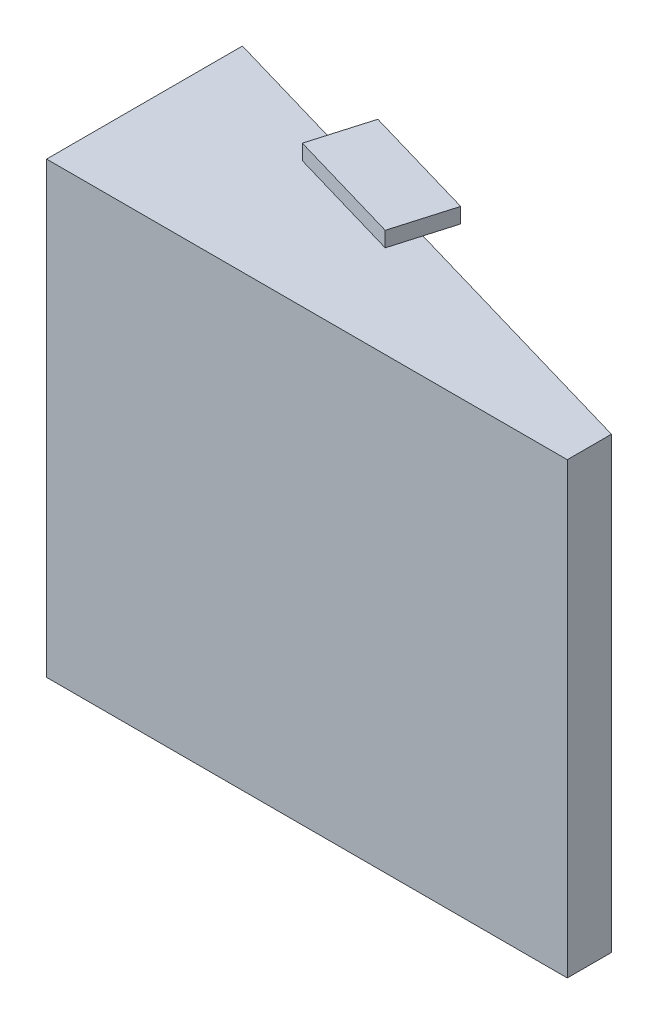
ISO-10303-21;
HEADER;
FILE_DESCRIPTION(('STEP AP214'),'2;1');
FILE_NAME('part.step','',(''),(''),'','','');
FILE_SCHEMA(('AUTOMOTIVE_DESIGN { 1 0 10303 214 1 1 1 1 }'));
ENDSEC;
DATA;
#1=APPLICATION_CONTEXT('core data for automotive mechanical design processes');
#2=APPLICATION_PROTOCOL_DEFINITION('international standard','automotive_design',2000,#1);
#3=PRODUCT_CONTEXT('',#1,'mechanical');
#4=PRODUCT('Part','Part','',(#3));
#5=PRODUCT_RELATED_PRODUCT_CATEGORY('part','',(#4));
#6=PRODUCT_DEFINITION_FORMATION('','',#4);
#7=PRODUCT_DEFINITION_CONTEXT('part definition',#1,'design');
#8=PRODUCT_DEFINITION('design','',#6,#7);
#9=PRODUCT_DEFINITION_SHAPE('','',#8);
#10=(LENGTH_UNIT() NAMED_UNIT(*) SI_UNIT(.MILLI.,.METRE.));
#11=(NAMED_UNIT(*) PLANE_ANGLE_UNIT() SI_UNIT($,.RADIAN.));
#12=(NAMED_UNIT(*) SI_UNIT($,.STERADIAN.) SOLID_ANGLE_UNIT());
#13=UNCERTAINTY_MEASURE_WITH_UNIT(LENGTH_MEASURE(1.E-05),#10,'distance_accuracy_value','');
#14=(GEOMETRIC_REPRESENTATION_CONTEXT(3) GLOBAL_UNCERTAINTY_ASSIGNED_CONTEXT((#13)) GLOBAL_UNIT_ASSIGNED_CONTEXT((#10,
#11,#12)) REPRESENTATION_CONTEXT('',''));
#15=CARTESIAN_POINT('',(0.,0.,0.));
#16=DIRECTION('',(0.,0.,1.));
#17=DIRECTION('',(1.,0.,0.));
#18=AXIS2_PLACEMENT_3D('',#15,#16,#17);
#19=CARTESIAN_POINT('',(0.,0.,0.));
#20=DIRECTION('',(0.,1.,0.));
#21=DIRECTION('',(0.,0.,1.));
#22=AXIS2_PLACEMENT_3D('',#19,#20,#21);
#23=PLANE('',#22);
#24=DIRECTION('',(-0.279720192664719,0.,0.960081566230501));
#25=VECTOR('',#24,1.);
#26=CARTESIAN_POINT('',(-9.66277044447101,0.,1.88743222874271));
#27=LINE('',#26,#25);
#28=CARTESIAN_POINT('',(-9.10333005914157,0.,-0.0327309037182961));
#29=VERTEX_POINT('',#28);
#30=CARTESIAN_POINT('',(-9.66277044447101,0.,1.88743222874271));
#31=VERTEX_POINT('',#30);
#32=EDGE_CURVE('E47',#29,#31,#27,.T.);
#33=ORIENTED_EDGE('',*,*,#32,.F.);
#34=DIRECTION('',(-0.960081566230501,0.,-0.279720192664719));
#35=VECTOR('',#34,1.);
#36=CARTESIAN_POINT('',(-25.843422974315,0.,-4.90996444320009));
#37=LINE('',#36,#35);
#38=CARTESIAN_POINT('',(8.37657702568498,0.,5.06004782416239));
#39=VERTEX_POINT('',#38);
#40=EDGE_CURVE('E347',#39,#29,#37,.T.);
#41=ORIENTED_EDGE('',*,*,#40,.F.);
#42=DIRECTION('',(0.,0.,-1.));
#43=VECTOR('',#42,1.);
#44=CARTESIAN_POINT('',(8.37657702568498,0.,5.06004782416239));
#45=LINE('',#44,#43);
#46=CARTESIAN_POINT('',(8.37657702568498,0.,7.96004782416239));
#47=VERTEX_POINT('',#46);
#48=EDGE_CURVE('E344',#47,#39,#45,.T.);
#49=ORIENTED_EDGE('',*,*,#48,.F.);
#50=DIRECTION('',(1.,0.,0.));
#51=VECTOR('',#50,1.);
#52=CARTESIAN_POINT('',(-25.843422974315,0.,7.96004782416239));
#53=LINE('',#52,#51);
#54=CARTESIAN_POINT('',(-25.843422974315,0.,7.96004782416239));
#55=VERTEX_POINT('',#54);
#56=EDGE_CURVE('E321',#55,#47,#53,.T.);
#57=ORIENTED_EDGE('',*,*,#56,.F.);
#58=DIRECTION('',(0.,0.,1.));
#59=VECTOR('',#58,1.);
#60=CARTESIAN_POINT('',(-25.843422974315,0.,5.06004782416239));
#61=LINE('',#60,#59);
#62=CARTESIAN_POINT('',(-25.843422974315,0.,-4.90996444320009));
#63=VERTEX_POINT('',#62);
#64=EDGE_CURVE('E333',#63,#55,#61,.T.);
#65=ORIENTED_EDGE('',*,*,#64,.F.);
#66=CARTESIAN_POINT('',(-16.7839825889856,0.,-2.27049244503605));
#67=VERTEX_POINT('',#66);
#68=EDGE_CURVE('E346',#67,#63,#37,.T.);
#69=ORIENTED_EDGE('',*,*,#68,.F.);
#70=DIRECTION('',(0.279720192664719,0.,-0.960081566230501));
#71=VECTOR('',#70,1.);
#72=CARTESIAN_POINT('',(-17.343422974315,0.,-0.350329312575044));
#73=LINE('',#72,#71);
#74=CARTESIAN_POINT('',(-17.343422974315,0.,-0.350329312575044));
#75=VERTEX_POINT('',#74);
#76=EDGE_CURVE('E238',#75,#67,#73,.T.);
#77=ORIENTED_EDGE('',*,*,#76,.F.);
#78=DIRECTION('',(-0.960081566230502,0.,-0.279720192664719));
#79=VECTOR('',#78,1.);
#80=CARTESIAN_POINT('',(-9.66277044447101,0.,1.88743222874271));
#81=LINE('',#80,#79);
#82=EDGE_CURVE('E218',#31,#75,#81,.T.);
#83=ORIENTED_EDGE('',*,*,#82,.F.);
#84=EDGE_LOOP('',(#33,#41,#49,#57,#65,#69,#77,#83));
#85=FACE_BOUND('',#84,.T.);
#86=ADVANCED_FACE('F38',(#85),#23,.F.);
#87=CARTESIAN_POINT('',(-23.541557769049,1.5,1.48936494172654));
#88=DIRECTION('',(-0.960081566230501,0.,-0.279720192664719));
#89=DIRECTION('',(-0.279720192664719,0.,0.960081566230501));
#90=AXIS2_PLACEMENT_3D('',#87,#88,#89);
#91=PLANE('',#90);
#92=DIRECTION('',(0.,1.,0.));
#93=VECTOR('',#92,1.);
#94=CARTESIAN_POINT('',(-22.003096709393,1.5,-3.79108367254121));
#95=LINE('',#94,#93);
#96=CARTESIAN_POINT('',(-22.003096709393,1.5,-3.79108367254121));
#97=VERTEX_POINT('',#96);
#98=CARTESIAN_POINT('',(-22.003096709393,3.,-3.79108367254121));
#99=VERTEX_POINT('',#98);
#100=EDGE_CURVE('E314',#97,#99,#95,.T.);
#101=ORIENTED_EDGE('',*,*,#100,.T.);
#102=DIRECTION('',(0.279720192664719,0.,-0.960081566230501));
#103=VECTOR('',#102,1.);
#104=CARTESIAN_POINT('',(-21.7860764850736,3.,-4.53596059716869));
#105=LINE('',#104,#103);
#106=CARTESIAN_POINT('',(-23.541557769049,3.,1.48936494172655));
#107=VERTEX_POINT('',#106);
#108=EDGE_CURVE('E270',#107,#99,#105,.T.);
#109=ORIENTED_EDGE('',*,*,#108,.F.);
#110=DIRECTION('',(0.,1.,0.));
#111=VECTOR('',#110,1.);
#112=CARTESIAN_POINT('',(-23.541557769049,1.5,1.48936494172654));
#113=LINE('',#112,#111);
#114=CARTESIAN_POINT('',(-23.541557769049,1.5,1.48936494172654));
#115=VERTEX_POINT('',#114);
#116=EDGE_CURVE('E301',#115,#107,#113,.T.);
#117=ORIENTED_EDGE('',*,*,#116,.F.);
#118=DIRECTION('',(0.279720192664719,0.,-0.960081566230501));
#119=VECTOR('',#118,1.);
#120=CARTESIAN_POINT('',(-23.541557769049,1.5,1.48936494172654));
#121=LINE('',#120,#119);
#122=EDGE_CURVE('E325',#115,#97,#121,.T.);
#123=ORIENTED_EDGE('',*,*,#122,.T.);
#124=EDGE_LOOP('',(#101,#109,#117,#123));
#125=FACE_BOUND('',#124,.T.);
#126=ADVANCED_FACE('F441',(#125),#91,.F.);
#127=CARTESIAN_POINT('',(-25.843422974315,29.5,7.96004782416239));
#128=DIRECTION('',(0.,0.,-1.));
#129=DIRECTION('',(-1.,0.,0.));
#130=AXIS2_PLACEMENT_3D('',#127,#128,#129);
#131=PLANE('',#130);
#132=ORIENTED_EDGE('',*,*,#56,.T.);
#133=DIRECTION('',(0.,-1.,0.));
#134=VECTOR('',#133,1.);
#135=CARTESIAN_POINT('',(8.37657702568498,29.5,7.96004782416239));
#136=LINE('',#135,#134);
#137=CARTESIAN_POINT('',(8.37657702568498,29.5,7.96004782416239));
#138=VERTEX_POINT('',#137);
#139=EDGE_CURVE('E358',#138,#47,#136,.T.);
#140=ORIENTED_EDGE('',*,*,#139,.F.);
#141=DIRECTION('',(1.,0.,0.));
#142=VECTOR('',#141,1.);
#143=CARTESIAN_POINT('',(-25.843422974315,29.5,7.96004782416239));
#144=LINE('',#143,#142);
#145=CARTESIAN_POINT('',(-25.843422974315,29.5,7.96004782416239));
#146=VERTEX_POINT('',#145);
#147=EDGE_CURVE('E332',#146,#138,#144,.T.);
#148=ORIENTED_EDGE('',*,*,#147,.F.);
#149=DIRECTION('',(0.,-1.,0.));
#150=VECTOR('',#149,1.);
#151=CARTESIAN_POINT('',(-25.843422974315,29.5,7.96004782416239));
#152=LINE('',#151,#150);
#153=EDGE_CURVE('E361',#146,#55,#152,.T.);
#154=ORIENTED_EDGE('',*,*,#153,.T.);
#155=EDGE_LOOP('',(#132,#140,#148,#154));
#156=FACE_BOUND('',#155,.T.);
#157=ADVANCED_FACE('F40',(#156),#131,.F.);
#158=CARTESIAN_POINT('',(8.37657702568498,29.5,5.06004782416239));
#159=DIRECTION('',(-1.,0.,0.));
#160=DIRECTION('',(0.,0.,1.));
#161=AXIS2_PLACEMENT_3D('',#158,#159,#160);
#162=PLANE('',#161);
#163=ORIENTED_EDGE('',*,*,#48,.T.);
#164=DIRECTION('',(0.,-1.,0.));
#165=VECTOR('',#164,1.);
#166=CARTESIAN_POINT('',(8.37657702568498,29.5,5.06004782416239));
#167=LINE('',#166,#165);
#168=CARTESIAN_POINT('',(8.37657702568498,29.5,5.06004782416239));
#169=VERTEX_POINT('',#168);
#170=EDGE_CURVE('E355',#169,#39,#167,.T.);
#171=ORIENTED_EDGE('',*,*,#170,.F.);
#172=DIRECTION('',(0.,0.,-1.));
#173=VECTOR('',#172,1.);
#174=CARTESIAN_POINT('',(8.37657702568498,29.5,5.06004782416239));
#175=LINE('',#174,#173);
#176=EDGE_CURVE('E335',#138,#169,#175,.T.);
#177=ORIENTED_EDGE('',*,*,#176,.F.);
#178=ORIENTED_EDGE('',*,*,#139,.T.);
#179=EDGE_LOOP('',(#163,#171,#177,#178));
#180=FACE_BOUND('',#179,.T.);
#181=ADVANCED_FACE('F474',(#180),#162,.F.);
#182=CARTESIAN_POINT('',(-25.843422974315,29.5,-4.90996444320009));
#183=DIRECTION('',(-0.279720192664719,0.,0.960081566230501));
#184=DIRECTION('',(0.960081566230501,0.,0.279720192664719));
#185=AXIS2_PLACEMENT_3D('',#182,#183,#184);
#186=PLANE('',#185);
#187=DIRECTION('',(0.,-1.,0.));
#188=VECTOR('',#187,1.);
#189=CARTESIAN_POINT('',(-25.843422974315,29.5,-4.90996444320009));
#190=LINE('',#189,#188);
#191=CARTESIAN_POINT('',(-25.843422974315,3.,-4.90996444320009));
#192=VERTEX_POINT('',#191);
#193=EDGE_CURVE('E341',#192,#63,#190,.T.);
#194=ORIENTED_EDGE('',*,*,#193,.F.);
#195=DIRECTION('',(0.960081566230501,0.,0.279720192664719));
#196=VECTOR('',#195,1.);
#197=CARTESIAN_POINT('',(-25.843422974315,3.,-4.90996444320009));
#198=LINE('',#197,#196);
#199=EDGE_CURVE('E289',#192,#99,#198,.T.);
#200=ORIENTED_EDGE('',*,*,#199,.T.);
#201=ORIENTED_EDGE('',*,*,#100,.F.);
#202=DIRECTION('',(-0.960081566230501,0.,-0.279720192664719));
#203=VECTOR('',#202,1.);
#204=CARTESIAN_POINT('',(-2.32142460166774,1.5,1.94318027708552));
#205=LINE('',#204,#203);
#206=CARTESIAN_POINT('',(-2.32142460166774,1.5,1.94318027708552));
#207=VERTEX_POINT('',#206);
#208=EDGE_CURVE('E310',#207,#97,#205,.T.);
#209=ORIENTED_EDGE('',*,*,#208,.F.);
#210=DIRECTION('',(0.,-1.,0.));
#211=VECTOR('',#210,1.);
#212=CARTESIAN_POINT('',(-2.32142460166774,1.5,1.94318027708552));
#213=LINE('',#212,#211);
#214=CARTESIAN_POINT('',(-2.32142460166774,28.,1.94318027708552));
#215=VERTEX_POINT('',#214);
#216=EDGE_CURVE('E292',#215,#207,#213,.T.);
#217=ORIENTED_EDGE('',*,*,#216,.F.);
#218=DIRECTION('',(0.960081566230501,0.,0.279720192664719));
#219=VECTOR('',#218,1.);
#220=CARTESIAN_POINT('',(-2.32142460166774,28.,1.94318027708552));
#221=LINE('',#220,#219);
#222=CARTESIAN_POINT('',(-22.003096709393,28.,-3.79108367254121));
#223=VERTEX_POINT('',#222);
#224=EDGE_CURVE('E297',#223,#215,#221,.T.);
#225=ORIENTED_EDGE('',*,*,#224,.F.);
#226=CARTESIAN_POINT('',(-22.003096709393,26.5,-3.79108367254121));
#227=VERTEX_POINT('',#226);
#228=EDGE_CURVE('E313',#227,#223,#95,.T.);
#229=ORIENTED_EDGE('',*,*,#228,.F.);
#230=DIRECTION('',(-0.960081566230501,0.,-0.279720192664719));
#231=VECTOR('',#230,1.);
#232=CARTESIAN_POINT('',(-25.843422974315,26.5,-4.90996444320009));
#233=LINE('',#232,#231);
#234=CARTESIAN_POINT('',(-25.843422974315,26.5,-4.90996444320009));
#235=VERTEX_POINT('',#234);
#236=EDGE_CURVE('E286',#227,#235,#233,.T.);
#237=ORIENTED_EDGE('',*,*,#236,.T.);
#238=CARTESIAN_POINT('',(-25.843422974315,29.5,-4.90996444320009));
#239=VERTEX_POINT('',#238);
#240=EDGE_CURVE('E352',#239,#235,#190,.T.);
#241=ORIENTED_EDGE('',*,*,#240,.F.);
#242=DIRECTION('',(-0.960081566230501,0.,-0.279720192664719));
#243=VECTOR('',#242,1.);
#244=CARTESIAN_POINT('',(-25.843422974315,29.5,-4.90996444320009));
#245=LINE('',#244,#243);
#246=CARTESIAN_POINT('',(-16.7839825889856,29.5,-2.27049244503605));
#247=VERTEX_POINT('',#246);
#248=EDGE_CURVE('E337',#247,#239,#245,.T.);
#249=ORIENTED_EDGE('',*,*,#248,.F.);
#250=CARTESIAN_POINT('',(-9.10333005914157,29.5,-0.0327309037182967));
#251=VERTEX_POINT('',#250);
#252=EDGE_CURVE('E342',#251,#247,#245,.T.);
#253=ORIENTED_EDGE('',*,*,#252,.F.);
#254=EDGE_CURVE('E338',#169,#251,#245,.T.);
#255=ORIENTED_EDGE('',*,*,#254,.F.);
#256=ORIENTED_EDGE('',*,*,#170,.T.);
#257=ORIENTED_EDGE('',*,*,#40,.T.);
#258=EDGE_CURVE('E350',#29,#67,#37,.T.);
#259=ORIENTED_EDGE('',*,*,#258,.T.);
#260=ORIENTED_EDGE('',*,*,#68,.T.);
#261=EDGE_LOOP('',(#194,#200,#201,#209,#217,#225,#229,#237,#241,#249,#253,#255,#256,#257,#259,#260));
#262=FACE_BOUND('',#261,.T.);
#263=ADVANCED_FACE('F402',(#262),#186,.F.);
#264=CARTESIAN_POINT('',(-25.843422974315,29.5,5.06004782416239));
#265=DIRECTION('',(1.,0.,0.));
#266=DIRECTION('',(0.,0.,-1.));
#267=AXIS2_PLACEMENT_3D('',#264,#265,#266);
#268=PLANE('',#267);
#269=DIRECTION('',(0.,1.,0.));
#270=VECTOR('',#269,1.);
#271=CARTESIAN_POINT('',(-25.843422974315,3.,2.51004782416239));
#272=LINE('',#271,#270);
#273=CARTESIAN_POINT('',(-25.843422974315,3.,2.51004782416239));
#274=VERTEX_POINT('',#273);
#275=CARTESIAN_POINT('',(-25.843422974315,26.5,2.51004782416239));
#276=VERTEX_POINT('',#275);
#277=EDGE_CURVE('E265',#274,#276,#272,.T.);
#278=ORIENTED_EDGE('',*,*,#277,.F.);
#279=DIRECTION('',(0.,0.,1.));
#280=VECTOR('',#279,1.);
#281=CARTESIAN_POINT('',(-25.843422974315,3.,2.51004782416239));
#282=LINE('',#281,#280);
#283=EDGE_CURVE('E277',#192,#274,#282,.T.);
#284=ORIENTED_EDGE('',*,*,#283,.F.);
#285=ORIENTED_EDGE('',*,*,#193,.T.);
#286=ORIENTED_EDGE('',*,*,#64,.T.);
#287=ORIENTED_EDGE('',*,*,#153,.F.);
#288=DIRECTION('',(0.,0.,1.));
#289=VECTOR('',#288,1.);
#290=CARTESIAN_POINT('',(-25.843422974315,29.5,5.06004782416239));
#291=LINE('',#290,#289);
#292=EDGE_CURVE('E329',#239,#146,#291,.T.);
#293=ORIENTED_EDGE('',*,*,#292,.F.);
#294=ORIENTED_EDGE('',*,*,#240,.T.);
#295=DIRECTION('',(0.,0.,-1.));
#296=VECTOR('',#295,1.);
#297=CARTESIAN_POINT('',(-25.843422974315,26.5,2.51004782416239));
#298=LINE('',#297,#296);
#299=EDGE_CURVE('E275',#276,#235,#298,.T.);
#300=ORIENTED_EDGE('',*,*,#299,.F.);
#301=EDGE_LOOP('',(#278,#284,#285,#286,#287,#293,#294,#300));
#302=FACE_BOUND('',#301,.T.);
#303=ADVANCED_FACE('F407',(#302),#268,.F.);
#304=CARTESIAN_POINT('',(0.,29.5,0.));
#305=DIRECTION('',(0.,1.,0.));
#306=DIRECTION('',(0.,0.,1.));
#307=AXIS2_PLACEMENT_3D('',#304,#305,#306);
#308=PLANE('',#307);
#309=DIRECTION('',(-0.279720192664719,0.,0.960081566230501));
#310=VECTOR('',#309,1.);
#311=CARTESIAN_POINT('',(-16.2245422036561,29.5,-4.19065557749705));
#312=LINE('',#311,#310);
#313=CARTESIAN_POINT('',(-17.343422974315,29.5,-0.350329312575044));
#314=VERTEX_POINT('',#313);
#315=EDGE_CURVE('E11',#247,#314,#312,.T.);
#316=ORIENTED_EDGE('',*,*,#315,.F.);
#317=ORIENTED_EDGE('',*,*,#248,.T.);
#318=ORIENTED_EDGE('',*,*,#292,.T.);
#319=ORIENTED_EDGE('',*,*,#147,.T.);
#320=ORIENTED_EDGE('',*,*,#176,.T.);
#321=ORIENTED_EDGE('',*,*,#254,.T.);
#322=DIRECTION('',(0.279720192664718,0.,-0.960081566230502));
#323=VECTOR('',#322,1.);
#324=CARTESIAN_POINT('',(-8.54388967381214,29.5,-1.9528940361793));
#325=LINE('',#324,#323);
#326=CARTESIAN_POINT('',(-9.66277044447101,29.5,1.88743222874271));
#327=VERTEX_POINT('',#326);
#328=EDGE_CURVE('E485',#327,#251,#325,.T.);
#329=ORIENTED_EDGE('',*,*,#328,.F.);
#330=DIRECTION('',(0.960081566230502,0.,0.279720192664719));
#331=VECTOR('',#330,1.);
#332=CARTESIAN_POINT('',(-17.343422974315,29.5,-0.350329312575044));
#333=LINE('',#332,#331);
#334=EDGE_CURVE('E56',#314,#327,#333,.T.);
#335=ORIENTED_EDGE('',*,*,#334,.F.);
#336=EDGE_LOOP('',(#316,#317,#318,#319,#320,#321,#329,#335));
#337=FACE_BOUND('',#336,.T.);
#338=ADVANCED_FACE('F469',(#337),#308,.T.);
#339=CARTESIAN_POINT('',(-3.85988566132369,1.5,7.22362889135328));
#340=DIRECTION('',(0.960081566230501,0.,0.279720192664719));
#341=DIRECTION('',(0.279720192664719,0.,-0.960081566230501));
#342=AXIS2_PLACEMENT_3D('',#339,#340,#341);
#343=PLANE('',#342);
#344=ORIENTED_EDGE('',*,*,#216,.T.);
#345=DIRECTION('',(0.279720192664719,0.,-0.960081566230501));
#346=VECTOR('',#345,1.);
#347=CARTESIAN_POINT('',(-3.85988566132369,1.5,7.22362889135328));
#348=LINE('',#347,#346);
#349=CARTESIAN_POINT('',(-3.85988566132369,1.5,7.22362889135328));
#350=VERTEX_POINT('',#349);
#351=EDGE_CURVE('E308',#350,#207,#348,.T.);
#352=ORIENTED_EDGE('',*,*,#351,.F.);
#353=DIRECTION('',(0.,-1.,0.));
#354=VECTOR('',#353,1.);
#355=CARTESIAN_POINT('',(-3.85988566132369,1.5,7.22362889135328));
#356=LINE('',#355,#354);
#357=CARTESIAN_POINT('',(-3.85988566132369,28.,7.22362889135328));
#358=VERTEX_POINT('',#357);
#359=EDGE_CURVE('E293',#358,#350,#356,.T.);
#360=ORIENTED_EDGE('',*,*,#359,.F.);
#361=DIRECTION('',(0.279720192664719,0.,-0.960081566230501));
#362=VECTOR('',#361,1.);
#363=CARTESIAN_POINT('',(-3.85988566132369,28.,7.22362889135328));
#364=LINE('',#363,#362);
#365=EDGE_CURVE('E319',#358,#215,#364,.T.);
#366=ORIENTED_EDGE('',*,*,#365,.T.);
#367=EDGE_LOOP('',(#344,#352,#360,#366));
#368=FACE_BOUND('',#367,.T.);
#369=ADVANCED_FACE('F693',(#368),#343,.F.);
#370=CARTESIAN_POINT('',(-3.85988566132369,28.,7.22362889135328));
#371=DIRECTION('',(0.,1.,0.));
#372=DIRECTION('',(0.,0.,1.));
#373=AXIS2_PLACEMENT_3D('',#370,#371,#372);
#374=PLANE('',#373);
#375=ORIENTED_EDGE('',*,*,#224,.T.);
#376=ORIENTED_EDGE('',*,*,#365,.F.);
#377=DIRECTION('',(0.960081566230501,0.,0.279720192664719));
#378=VECTOR('',#377,1.);
#379=CARTESIAN_POINT('',(-3.85988566132369,28.,7.22362889135328));
#380=LINE('',#379,#378);
#381=CARTESIAN_POINT('',(-23.541557769049,28.,1.48936494172654));
#382=VERTEX_POINT('',#381);
#383=EDGE_CURVE('E304',#382,#358,#380,.T.);
#384=ORIENTED_EDGE('',*,*,#383,.F.);
#385=DIRECTION('',(0.279720192664719,0.,-0.960081566230501));
#386=VECTOR('',#385,1.);
#387=CARTESIAN_POINT('',(-23.541557769049,28.,1.48936494172654));
#388=LINE('',#387,#386);
#389=EDGE_CURVE('E322',#382,#223,#388,.T.);
#390=ORIENTED_EDGE('',*,*,#389,.T.);
#391=EDGE_LOOP('',(#375,#376,#384,#390));
#392=FACE_BOUND('',#391,.T.);
#393=ADVANCED_FACE('F737',(#392),#374,.F.);
#394=CARTESIAN_POINT('',(-23.541557769049,26.5,1.48936494172654));
#395=VERTEX_POINT('',#394);
#396=EDGE_CURVE('E300',#395,#382,#113,.T.);
#397=ORIENTED_EDGE('',*,*,#396,.F.);
#398=DIRECTION('',(-0.279720192664719,0.,0.960081566230501));
#399=VECTOR('',#398,1.);
#400=CARTESIAN_POINT('',(-21.7860764850736,26.5,-4.53596059716869));
#401=LINE('',#400,#399);
#402=EDGE_CURVE('E285',#227,#395,#401,.T.);
#403=ORIENTED_EDGE('',*,*,#402,.F.);
#404=ORIENTED_EDGE('',*,*,#228,.T.);
#405=ORIENTED_EDGE('',*,*,#389,.F.);
#406=EDGE_LOOP('',(#397,#403,#404,#405));
#407=FACE_BOUND('',#406,.T.);
#408=ADVANCED_FACE('F425',(#407),#91,.F.);
#409=CARTESIAN_POINT('',(-3.85988566132369,1.5,7.22362889135328));
#410=DIRECTION('',(0.,-1.,0.));
#411=DIRECTION('',(0.,0.,-1.));
#412=AXIS2_PLACEMENT_3D('',#409,#410,#411);
#413=PLANE('',#412);
#414=ORIENTED_EDGE('',*,*,#208,.T.);
#415=ORIENTED_EDGE('',*,*,#122,.F.);
#416=DIRECTION('',(-0.960081566230501,0.,-0.279720192664719));
#417=VECTOR('',#416,1.);
#418=CARTESIAN_POINT('',(-3.85988566132369,1.5,7.22362889135328));
#419=LINE('',#418,#417);
#420=EDGE_CURVE('E296',#350,#115,#419,.T.);
#421=ORIENTED_EDGE('',*,*,#420,.F.);
#422=ORIENTED_EDGE('',*,*,#351,.T.);
#423=EDGE_LOOP('',(#414,#415,#421,#422));
#424=FACE_BOUND('',#423,.T.);
#425=ADVANCED_FACE('F584',(#424),#413,.F.);
#426=CARTESIAN_POINT('',(-2.24194640735171,0.,7.69501621484679));
#427=DIRECTION('',(-0.279720192664719,0.,0.960081566230501));
#428=DIRECTION('',(0.960081566230501,0.,0.279720192664719));
#429=AXIS2_PLACEMENT_3D('',#426,#427,#428);
#430=PLANE('',#429);
#431=CARTESIAN_POINT('',(-6.5481140467691,25.5,6.44041235189207));
#432=DIRECTION('',(-0.279720192664719,0.,0.960081566230501));
#433=DIRECTION('',(0.960081566230501,0.,0.279720192664719));
#434=AXIS2_PLACEMENT_3D('',#431,#432,#433);
#435=CIRCLE('',#434,1.15);
#436=CARTESIAN_POINT('',(-5.44402024560402,25.5,6.76209057345649));
#437=VERTEX_POINT('',#436);
#438=EDGE_CURVE('E42',#437,#437,#435,.F.);
#439=ORIENTED_EDGE('',*,*,#438,.F.);
#440=EDGE_LOOP('',(#439));
#441=FACE_BOUND('',#440,.T.);
#442=CARTESIAN_POINT('',(-6.5481140467691,3.9,6.44041235189207));
#443=DIRECTION('',(-0.279720192664719,0.,0.960081566230501));
#444=DIRECTION('',(0.960081566230501,0.,0.279720192664719));
#445=AXIS2_PLACEMENT_3D('',#442,#443,#444);
#446=CIRCLE('',#445,1.15);
#447=CARTESIAN_POINT('',(-5.44402024560402,3.9,6.76209057345649));
#448=VERTEX_POINT('',#447);
#449=EDGE_CURVE('E369',#448,#448,#446,.F.);
#450=ORIENTED_EDGE('',*,*,#449,.F.);
#451=EDGE_LOOP('',(#450));
#452=FACE_BOUND('',#451,.T.);
#453=CARTESIAN_POINT('',(-21.1413538534727,3.9,2.18866542338834));
#454=DIRECTION('',(-0.279720192664719,0.,0.960081566230501));
#455=DIRECTION('',(0.960081566230501,0.,0.279720192664719));
#456=AXIS2_PLACEMENT_3D('',#453,#454,#455);
#457=CIRCLE('',#456,1.15);
#458=CARTESIAN_POINT('',(-20.0372600523076,3.9,2.51034364495277));
#459=VERTEX_POINT('',#458);
#460=EDGE_CURVE('E367',#459,#459,#457,.F.);
#461=ORIENTED_EDGE('',*,*,#460,.F.);
#462=EDGE_LOOP('',(#461));
#463=FACE_BOUND('',#462,.T.);
#464=CARTESIAN_POINT('',(-21.1413538534727,25.5,2.18866542338834));
#465=DIRECTION('',(-0.279720192664719,0.,0.960081566230501));
#466=DIRECTION('',(0.960081566230501,0.,0.279720192664719));
#467=AXIS2_PLACEMENT_3D('',#464,#465,#466);
#468=CIRCLE('',#467,1.15);
#469=CARTESIAN_POINT('',(-20.0372600523076,25.5,2.51034364495277));
#470=VERTEX_POINT('',#469);
#471=EDGE_CURVE('E364',#470,#470,#468,.F.);
#472=ORIENTED_EDGE('',*,*,#471,.F.);
#473=EDGE_LOOP('',(#472));
#474=FACE_BOUND('',#473,.T.);
#475=ORIENTED_EDGE('',*,*,#359,.T.);
#476=ORIENTED_EDGE('',*,*,#420,.T.);
#477=ORIENTED_EDGE('',*,*,#116,.T.);
#478=EDGE_CURVE('E305',#107,#395,#113,.T.);
#479=ORIENTED_EDGE('',*,*,#478,.T.);
#480=ORIENTED_EDGE('',*,*,#396,.T.);
#481=ORIENTED_EDGE('',*,*,#383,.T.);
#482=EDGE_LOOP('',(#475,#476,#477,#479,#480,#481));
#483=FACE_BOUND('',#482,.T.);
#484=ADVANCED_FACE('F430',(#441,#452,#463,#474,#483),#430,.F.);
#485=CARTESIAN_POINT('',(2.397886554496,3.,2.51004782416239));
#486=DIRECTION('',(0.,-1.,0.));
#487=DIRECTION('',(0.,0.,-1.));
#488=AXIS2_PLACEMENT_3D('',#485,#486,#487);
#489=PLANE('',#488);
#490=ORIENTED_EDGE('',*,*,#283,.T.);
#491=DIRECTION('',(-1.,0.,0.));
#492=VECTOR('',#491,1.);
#493=CARTESIAN_POINT('',(2.397886554496,3.,2.51004782416239));
#494=LINE('',#493,#492);
#495=CARTESIAN_POINT('',(-23.8389341822276,3.,2.51004782416239));
#496=VERTEX_POINT('',#495);
#497=EDGE_CURVE('E281',#496,#274,#494,.T.);
#498=ORIENTED_EDGE('',*,*,#497,.F.);
#499=EDGE_CURVE('E266',#496,#107,#105,.T.);
#500=ORIENTED_EDGE('',*,*,#499,.T.);
#501=ORIENTED_EDGE('',*,*,#108,.T.);
#502=ORIENTED_EDGE('',*,*,#199,.F.);
#503=EDGE_LOOP('',(#490,#498,#500,#501,#502));
#504=FACE_BOUND('',#503,.T.);
#505=ADVANCED_FACE('F439',(#504),#489,.F.);
#506=CARTESIAN_POINT('',(2.397886554496,26.5,2.51004782416239));
#507=DIRECTION('',(0.,1.,0.));
#508=DIRECTION('',(0.,0.,1.));
#509=AXIS2_PLACEMENT_3D('',#506,#507,#508);
#510=PLANE('',#509);
#511=ORIENTED_EDGE('',*,*,#402,.T.);
#512=CARTESIAN_POINT('',(-23.8389341822276,26.5,2.51004782416239));
#513=VERTEX_POINT('',#512);
#514=EDGE_CURVE('E272',#395,#513,#401,.T.);
#515=ORIENTED_EDGE('',*,*,#514,.T.);
#516=DIRECTION('',(-1.,0.,0.));
#517=VECTOR('',#516,1.);
#518=CARTESIAN_POINT('',(2.397886554496,26.5,2.51004782416239));
#519=LINE('',#518,#517);
#520=EDGE_CURVE('E280',#513,#276,#519,.T.);
#521=ORIENTED_EDGE('',*,*,#520,.T.);
#522=ORIENTED_EDGE('',*,*,#299,.T.);
#523=ORIENTED_EDGE('',*,*,#236,.F.);
#524=EDGE_LOOP('',(#511,#515,#521,#522,#523));
#525=FACE_BOUND('',#524,.T.);
#526=ADVANCED_FACE('F421',(#525),#510,.F.);
#527=CARTESIAN_POINT('',(-23.541557769049,1.5,1.48936494172654));
#528=DIRECTION('',(-0.960081566230501,0.,-0.279720192664719));
#529=DIRECTION('',(-0.279720192664719,0.,0.960081566230501));
#530=AXIS2_PLACEMENT_3D('',#527,#528,#529);
#531=PLANE('',#530);
#532=ORIENTED_EDGE('',*,*,#478,.F.);
#533=ORIENTED_EDGE('',*,*,#499,.F.);
#534=DIRECTION('',(0.,-1.,0.));
#535=VECTOR('',#534,1.);
#536=CARTESIAN_POINT('',(-23.8389341822276,3.,2.51004782416239));
#537=LINE('',#536,#535);
#538=EDGE_CURVE('E269',#513,#496,#537,.T.);
#539=ORIENTED_EDGE('',*,*,#538,.F.);
#540=ORIENTED_EDGE('',*,*,#514,.F.);
#541=EDGE_LOOP('',(#532,#533,#539,#540));
#542=FACE_BOUND('',#541,.T.);
#543=ADVANCED_FACE('F434',(#542),#531,.T.);
#544=CARTESIAN_POINT('',(2.397886554496,3.,2.51004782416239));
#545=DIRECTION('',(0.,0.,1.));
#546=DIRECTION('',(1.,0.,0.));
#547=AXIS2_PLACEMENT_3D('',#544,#545,#546);
#548=PLANE('',#547);
#549=ORIENTED_EDGE('',*,*,#538,.T.);
#550=ORIENTED_EDGE('',*,*,#497,.T.);
#551=ORIENTED_EDGE('',*,*,#277,.T.);
#552=ORIENTED_EDGE('',*,*,#520,.F.);
#553=EDGE_LOOP('',(#549,#550,#551,#552));
#554=FACE_BOUND('',#553,.T.);
#555=ADVANCED_FACE('F447',(#554),#548,.F.);
#556=CARTESIAN_POINT('',(-20.5819134681433,25.5,0.268502290927341));
#557=DIRECTION('',(-0.279720192664719,0.,0.960081566230501));
#558=DIRECTION('',(0.960081566230501,0.,0.279720192664719));
#559=AXIS2_PLACEMENT_3D('',#556,#557,#558);
#560=CYLINDRICAL_SURFACE('',#559,1.15);
#561=CARTESIAN_POINT('',(-20.5819134681433,25.5,0.268502290927341));
#562=DIRECTION('',(0.279720192664719,0.,-0.960081566230502));
#563=DIRECTION('',(-0.960081566230502,0.,-0.279720192664719));
#564=AXIS2_PLACEMENT_3D('',#561,#562,#563);
#565=CIRCLE('',#564,1.15);
#566=CARTESIAN_POINT('',(-21.6860072693084,25.5,-0.0531759306370845));
#567=VERTEX_POINT('',#566);
#568=EDGE_CURVE('E262',#567,#567,#565,.T.);
#569=ORIENTED_EDGE('',*,*,#568,.F.);
#570=EDGE_LOOP('',(#569));
#571=FACE_BOUND('',#570,.T.);
#572=ORIENTED_EDGE('',*,*,#471,.T.);
#573=EDGE_LOOP('',(#572));
#574=FACE_BOUND('',#573,.T.);
#575=ADVANCED_FACE('F449',(#571,#574),#560,.T.);
#576=CARTESIAN_POINT('',(-20.5819134681433,25.5,0.268502290927341));
#577=DIRECTION('',(0.279720192664719,0.,-0.960081566230502));
#578=DIRECTION('',(-0.960081566230502,0.,-0.279720192664719));
#579=AXIS2_PLACEMENT_3D('',#576,#577,#578);
#580=PLANE('',#579);
#581=ORIENTED_EDGE('',*,*,#568,.T.);
#582=EDGE_LOOP('',(#581));
#583=FACE_BOUND('',#582,.T.);
#584=ADVANCED_FACE('F455',(#583),#580,.T.);
#585=CARTESIAN_POINT('',(-20.5819134681433,3.9,0.268502290927341));
#586=DIRECTION('',(-0.279720192664719,0.,0.960081566230501));
#587=DIRECTION('',(0.960081566230501,0.,0.279720192664719));
#588=AXIS2_PLACEMENT_3D('',#585,#586,#587);
#589=CYLINDRICAL_SURFACE('',#588,1.15);
#590=CARTESIAN_POINT('',(-20.5819134681433,3.9,0.268502290927341));
#591=DIRECTION('',(0.279720192664719,0.,-0.960081566230502));
#592=DIRECTION('',(-0.960081566230502,0.,-0.279720192664719));
#593=AXIS2_PLACEMENT_3D('',#590,#591,#592);
#594=CIRCLE('',#593,1.15);
#595=CARTESIAN_POINT('',(-21.6860072693084,3.9,-0.0531759306370857));
#596=VERTEX_POINT('',#595);
#597=EDGE_CURVE('E259',#596,#596,#594,.T.);
#598=ORIENTED_EDGE('',*,*,#597,.F.);
#599=EDGE_LOOP('',(#598));
#600=FACE_BOUND('',#599,.T.);
#601=ORIENTED_EDGE('',*,*,#460,.T.);
#602=EDGE_LOOP('',(#601));
#603=FACE_BOUND('',#602,.T.);
#604=ADVANCED_FACE('F552',(#600,#603),#589,.T.);
#605=CARTESIAN_POINT('',(-20.5819134681433,3.9,0.268502290927341));
#606=DIRECTION('',(0.279720192664719,0.,-0.960081566230502));
#607=DIRECTION('',(-0.960081566230502,0.,-0.279720192664719));
#608=AXIS2_PLACEMENT_3D('',#605,#606,#607);
#609=PLANE('',#608);
#610=ORIENTED_EDGE('',*,*,#597,.T.);
#611=EDGE_LOOP('',(#610));
#612=FACE_BOUND('',#611,.T.);
#613=ADVANCED_FACE('F548',(#612),#609,.T.);
#614=CARTESIAN_POINT('',(-5.98867366143966,3.9,4.52024921943107));
#615=DIRECTION('',(-0.279720192664719,0.,0.960081566230501));
#616=DIRECTION('',(0.960081566230501,0.,0.279720192664719));
#617=AXIS2_PLACEMENT_3D('',#614,#615,#616);
#618=CYLINDRICAL_SURFACE('',#617,1.15);
#619=CARTESIAN_POINT('',(-5.98867366143966,3.9,4.52024921943107));
#620=DIRECTION('',(0.279720192664719,0.,-0.960081566230502));
#621=DIRECTION('',(-0.960081566230502,0.,-0.279720192664719));
#622=AXIS2_PLACEMENT_3D('',#619,#620,#621);
#623=CIRCLE('',#622,1.15);
#624=CARTESIAN_POINT('',(-7.09276746260474,3.9,4.19857099786664));
#625=VERTEX_POINT('',#624);
#626=EDGE_CURVE('E256',#625,#625,#623,.T.);
#627=ORIENTED_EDGE('',*,*,#626,.F.);
#628=EDGE_LOOP('',(#627));
#629=FACE_BOUND('',#628,.T.);
#630=ORIENTED_EDGE('',*,*,#449,.T.);
#631=EDGE_LOOP('',(#630));
#632=FACE_BOUND('',#631,.T.);
#633=ADVANCED_FACE('F544',(#629,#632),#618,.T.);
#634=CARTESIAN_POINT('',(-5.98867366143966,3.9,4.52024921943107));
#635=DIRECTION('',(0.279720192664719,0.,-0.960081566230502));
#636=DIRECTION('',(-0.960081566230502,0.,-0.279720192664719));
#637=AXIS2_PLACEMENT_3D('',#634,#635,#636);
#638=PLANE('',#637);
#639=ORIENTED_EDGE('',*,*,#626,.T.);
#640=EDGE_LOOP('',(#639));
#641=FACE_BOUND('',#640,.T.);
#642=ADVANCED_FACE('F540',(#641),#638,.T.);
#643=CARTESIAN_POINT('',(-5.98867366143966,25.5,4.52024921943107));
#644=DIRECTION('',(-0.279720192664719,0.,0.960081566230501));
#645=DIRECTION('',(0.960081566230501,0.,0.279720192664719));
#646=AXIS2_PLACEMENT_3D('',#643,#644,#645);
#647=CYLINDRICAL_SURFACE('',#646,1.15);
#648=CARTESIAN_POINT('',(-5.98867366143966,25.5,4.52024921943107));
#649=DIRECTION('',(0.279720192664719,0.,-0.960081566230502));
#650=DIRECTION('',(-0.960081566230502,0.,-0.279720192664719));
#651=AXIS2_PLACEMENT_3D('',#648,#649,#650);
#652=CIRCLE('',#651,1.15);
#653=CARTESIAN_POINT('',(-7.09276746260474,25.5,4.19857099786664));
#654=VERTEX_POINT('',#653);
#655=EDGE_CURVE('E253',#654,#654,#652,.T.);
#656=ORIENTED_EDGE('',*,*,#655,.F.);
#657=EDGE_LOOP('',(#656));
#658=FACE_BOUND('',#657,.T.);
#659=ORIENTED_EDGE('',*,*,#438,.T.);
#660=EDGE_LOOP('',(#659));
#661=FACE_BOUND('',#660,.T.);
#662=ADVANCED_FACE('F536',(#658,#661),#647,.T.);
#663=CARTESIAN_POINT('',(-5.98867366143966,25.5,4.52024921943107));
#664=DIRECTION('',(0.279720192664719,0.,-0.960081566230502));
#665=DIRECTION('',(-0.960081566230502,0.,-0.279720192664719));
#666=AXIS2_PLACEMENT_3D('',#663,#664,#665);
#667=PLANE('',#666);
#668=ORIENTED_EDGE('',*,*,#655,.T.);
#669=EDGE_LOOP('',(#668));
#670=FACE_BOUND('',#669,.T.);
#671=ADVANCED_FACE('F523',(#670),#667,.T.);
#672=CARTESIAN_POINT('',(0.,0.,0.));
#673=DIRECTION('',(0.,1.,0.));
#674=DIRECTION('',(0.,0.,1.));
#675=AXIS2_PLACEMENT_3D('',#672,#673,#674);
#676=PLANE('',#675);
#677=ORIENTED_EDGE('',*,*,#258,.F.);
#678=CARTESIAN_POINT('',(-8.54388967381213,0.,-1.9528940361793));
#679=VERTEX_POINT('',#678);
#680=EDGE_CURVE('E215',#679,#29,#27,.T.);
#681=ORIENTED_EDGE('',*,*,#680,.F.);
#682=DIRECTION('',(0.960081566230501,0.,0.279720192664719));
#683=VECTOR('',#682,1.);
#684=CARTESIAN_POINT('',(-8.54388967381213,0.,-1.9528940361793));
#685=LINE('',#684,#683);
#686=CARTESIAN_POINT('',(-16.2245422036561,0.,-4.19065557749705));
#687=VERTEX_POINT('',#686);
#688=EDGE_CURVE('E228',#687,#679,#685,.T.);
#689=ORIENTED_EDGE('',*,*,#688,.F.);
#690=EDGE_CURVE('E237',#67,#687,#73,.T.);
#691=ORIENTED_EDGE('',*,*,#690,.F.);
#692=EDGE_LOOP('',(#677,#681,#689,#691));
#693=FACE_BOUND('',#692,.T.);
#694=ADVANCED_FACE('F396',(#693),#676,.T.);
#695=CARTESIAN_POINT('',(-9.66277044447101,-1.,1.88743222874271));
#696=DIRECTION('',(-0.960081566230501,0.,-0.279720192664719));
#697=DIRECTION('',(-0.279720192664719,0.,0.960081566230501));
#698=AXIS2_PLACEMENT_3D('',#695,#696,#697);
#699=PLANE('',#698);
#700=ORIENTED_EDGE('',*,*,#680,.T.);
#701=ORIENTED_EDGE('',*,*,#32,.T.);
#702=DIRECTION('',(0.,1.,0.));
#703=VECTOR('',#702,1.);
#704=CARTESIAN_POINT('',(-9.66277044447101,-1.,1.88743222874271));
#705=LINE('',#704,#703);
#706=CARTESIAN_POINT('',(-9.66277044447101,-1.,1.88743222874271));
#707=VERTEX_POINT('',#706);
#708=EDGE_CURVE('E250',#707,#31,#705,.T.);
#709=ORIENTED_EDGE('',*,*,#708,.F.);
#710=DIRECTION('',(-0.279720192664719,0.,0.960081566230501));
#711=VECTOR('',#710,1.);
#712=CARTESIAN_POINT('',(-9.66277044447101,-1.,1.88743222874271));
#713=LINE('',#712,#711);
#714=CARTESIAN_POINT('',(-8.54388967381213,-1.,-1.9528940361793));
#715=VERTEX_POINT('',#714);
#716=EDGE_CURVE('E224',#715,#707,#713,.T.);
#717=ORIENTED_EDGE('',*,*,#716,.F.);
#718=DIRECTION('',(0.,1.,0.));
#719=VECTOR('',#718,1.);
#720=CARTESIAN_POINT('',(-8.54388967381213,-1.,-1.9528940361793));
#721=LINE('',#720,#719);
#722=EDGE_CURVE('E233',#715,#679,#721,.T.);
#723=ORIENTED_EDGE('',*,*,#722,.T.);
#724=EDGE_LOOP('',(#700,#701,#709,#717,#723));
#725=FACE_BOUND('',#724,.T.);
#726=ADVANCED_FACE('F379',(#725),#699,.F.);
#727=CARTESIAN_POINT('',(-9.66277044447101,-1.,1.88743222874271));
#728=DIRECTION('',(0.279720192664719,0.,-0.960081566230501));
#729=DIRECTION('',(-0.960081566230501,0.,-0.279720192664719));
#730=AXIS2_PLACEMENT_3D('',#727,#728,#729);
#731=PLANE('',#730);
#732=ORIENTED_EDGE('',*,*,#82,.T.);
#733=DIRECTION('',(0.,1.,0.));
#734=VECTOR('',#733,1.);
#735=CARTESIAN_POINT('',(-17.343422974315,-1.,-0.350329312575044));
#736=LINE('',#735,#734);
#737=CARTESIAN_POINT('',(-17.343422974315,-1.,-0.350329312575044));
#738=VERTEX_POINT('',#737);
#739=EDGE_CURVE('E247',#738,#75,#736,.T.);
#740=ORIENTED_EDGE('',*,*,#739,.F.);
#741=DIRECTION('',(-0.960081566230502,0.,-0.279720192664719));
#742=VECTOR('',#741,1.);
#743=CARTESIAN_POINT('',(-9.66277044447101,-1.,1.88743222874271));
#744=LINE('',#743,#742);
#745=EDGE_CURVE('E227',#707,#738,#744,.T.);
#746=ORIENTED_EDGE('',*,*,#745,.F.);
#747=ORIENTED_EDGE('',*,*,#708,.T.);
#748=EDGE_LOOP('',(#732,#740,#746,#747));
#749=FACE_BOUND('',#748,.T.);
#750=ADVANCED_FACE('F385',(#749),#731,.F.);
#751=CARTESIAN_POINT('',(-17.343422974315,-1.,-0.350329312575044));
#752=DIRECTION('',(0.960081566230501,0.,0.279720192664719));
#753=DIRECTION('',(0.279720192664719,0.,-0.960081566230501));
#754=AXIS2_PLACEMENT_3D('',#751,#752,#753);
#755=PLANE('',#754);
#756=ORIENTED_EDGE('',*,*,#76,.T.);
#757=ORIENTED_EDGE('',*,*,#690,.T.);
#758=DIRECTION('',(0.,1.,0.));
#759=VECTOR('',#758,1.);
#760=CARTESIAN_POINT('',(-16.2245422036561,-1.,-4.19065557749705));
#761=LINE('',#760,#759);
#762=CARTESIAN_POINT('',(-16.2245422036561,-1.,-4.19065557749705));
#763=VERTEX_POINT('',#762);
#764=EDGE_CURVE('E244',#763,#687,#761,.T.);
#765=ORIENTED_EDGE('',*,*,#764,.F.);
#766=DIRECTION('',(0.279720192664719,0.,-0.960081566230501));
#767=VECTOR('',#766,1.);
#768=CARTESIAN_POINT('',(-17.343422974315,-1.,-0.350329312575044));
#769=LINE('',#768,#767);
#770=EDGE_CURVE('E230',#738,#763,#769,.T.);
#771=ORIENTED_EDGE('',*,*,#770,.F.);
#772=ORIENTED_EDGE('',*,*,#739,.T.);
#773=EDGE_LOOP('',(#756,#757,#765,#771,#772));
#774=FACE_BOUND('',#773,.T.);
#775=ADVANCED_FACE('F526',(#774),#755,.F.);
#776=CARTESIAN_POINT('',(-8.54388967381213,-1.,-1.9528940361793));
#777=DIRECTION('',(-0.279720192664719,0.,0.960081566230501));
#778=DIRECTION('',(0.960081566230501,0.,0.279720192664719));
#779=AXIS2_PLACEMENT_3D('',#776,#777,#778);
#780=PLANE('',#779);
#781=ORIENTED_EDGE('',*,*,#688,.T.);
#782=ORIENTED_EDGE('',*,*,#722,.F.);
#783=DIRECTION('',(0.960081566230501,0.,0.279720192664719));
#784=VECTOR('',#783,1.);
#785=CARTESIAN_POINT('',(-8.54388967381213,-1.,-1.9528940361793));
#786=LINE('',#785,#784);
#787=EDGE_CURVE('E232',#763,#715,#786,.T.);
#788=ORIENTED_EDGE('',*,*,#787,.F.);
#789=ORIENTED_EDGE('',*,*,#764,.T.);
#790=EDGE_LOOP('',(#781,#782,#788,#789));
#791=FACE_BOUND('',#790,.T.);
#792=ADVANCED_FACE('F520',(#791),#780,.F.);
#793=CARTESIAN_POINT('',(0.,-1.,0.));
#794=DIRECTION('',(0.,1.,0.));
#795=DIRECTION('',(0.,0.,1.));
#796=AXIS2_PLACEMENT_3D('',#793,#794,#795);
#797=PLANE('',#796);
#798=ORIENTED_EDGE('',*,*,#716,.T.);
#799=ORIENTED_EDGE('',*,*,#745,.T.);
#800=ORIENTED_EDGE('',*,*,#770,.T.);
#801=ORIENTED_EDGE('',*,*,#787,.T.);
#802=EDGE_LOOP('',(#798,#799,#800,#801));
#803=FACE_BOUND('',#802,.T.);
#804=ADVANCED_FACE('F389',(#803),#797,.F.);
#805=CARTESIAN_POINT('',(0.,29.5,0.));
#806=DIRECTION('',(0.,1.,0.));
#807=DIRECTION('',(0.,0.,1.));
#808=AXIS2_PLACEMENT_3D('',#805,#806,#807);
#809=PLANE('',#808);
#810=CARTESIAN_POINT('',(-8.54388967381214,29.5,-1.9528940361793));
#811=VERTEX_POINT('',#810);
#812=EDGE_CURVE('E488',#251,#811,#325,.T.);
#813=ORIENTED_EDGE('',*,*,#812,.F.);
#814=ORIENTED_EDGE('',*,*,#252,.T.);
#815=CARTESIAN_POINT('',(-16.2245422036561,29.5,-4.19065557749705));
#816=VERTEX_POINT('',#815);
#817=EDGE_CURVE('E49',#816,#247,#312,.T.);
#818=ORIENTED_EDGE('',*,*,#817,.F.);
#819=DIRECTION('',(-0.960081566230502,0.,-0.279720192664719));
#820=VECTOR('',#819,1.);
#821=CARTESIAN_POINT('',(-16.2245422036561,29.5,-4.19065557749705));
#822=LINE('',#821,#820);
#823=EDGE_CURVE('E211',#811,#816,#822,.T.);
#824=ORIENTED_EDGE('',*,*,#823,.F.);
#825=EDGE_LOOP('',(#813,#814,#818,#824));
#826=FACE_BOUND('',#825,.T.);
#827=ADVANCED_FACE('F489',(#826),#809,.F.);
#828=CARTESIAN_POINT('',(-16.2245422036561,30.5,-4.19065557749705));
#829=DIRECTION('',(0.960081566230501,0.,0.279720192664719));
#830=DIRECTION('',(0.279720192664719,0.,-0.960081566230501));
#831=AXIS2_PLACEMENT_3D('',#828,#829,#830);
#832=PLANE('',#831);
#833=ORIENTED_EDGE('',*,*,#817,.T.);
#834=ORIENTED_EDGE('',*,*,#315,.T.);
#835=DIRECTION('',(0.,-1.,0.));
#836=VECTOR('',#835,1.);
#837=CARTESIAN_POINT('',(-17.343422974315,30.5,-0.350329312575044));
#838=LINE('',#837,#836);
#839=CARTESIAN_POINT('',(-17.343422974315,30.5,-0.350329312575044));
#840=VERTEX_POINT('',#839);
#841=EDGE_CURVE('E196',#840,#314,#838,.T.);
#842=ORIENTED_EDGE('',*,*,#841,.F.);
#843=DIRECTION('',(-0.279720192664719,0.,0.960081566230501));
#844=VECTOR('',#843,1.);
#845=CARTESIAN_POINT('',(-16.2245422036561,30.5,-4.19065557749705));
#846=LINE('',#845,#844);
#847=CARTESIAN_POINT('',(-16.2245422036561,30.5,-4.19065557749705));
#848=VERTEX_POINT('',#847);
#849=EDGE_CURVE('E202',#848,#840,#846,.T.);
#850=ORIENTED_EDGE('',*,*,#849,.F.);
#851=DIRECTION('',(0.,-1.,0.));
#852=VECTOR('',#851,1.);
#853=CARTESIAN_POINT('',(-16.2245422036561,30.5,-4.19065557749705));
#854=LINE('',#853,#852);
#855=EDGE_CURVE('E499',#848,#816,#854,.T.);
#856=ORIENTED_EDGE('',*,*,#855,.T.);
#857=EDGE_LOOP('',(#833,#834,#842,#850,#856));
#858=FACE_BOUND('',#857,.T.);
#859=ADVANCED_FACE('F214',(#858),#832,.F.);
#860=CARTESIAN_POINT('',(-17.343422974315,30.5,-0.350329312575044));
#861=DIRECTION('',(0.279720192664719,0.,-0.960081566230501));
#862=DIRECTION('',(-0.960081566230501,0.,-0.279720192664719));
#863=AXIS2_PLACEMENT_3D('',#860,#861,#862);
#864=PLANE('',#863);
#865=ORIENTED_EDGE('',*,*,#334,.T.);
#866=DIRECTION('',(0.,-1.,0.));
#867=VECTOR('',#866,1.);
#868=CARTESIAN_POINT('',(-9.66277044447101,30.5,1.88743222874271));
#869=LINE('',#868,#867);
#870=CARTESIAN_POINT('',(-9.66277044447101,30.5,1.88743222874271));
#871=VERTEX_POINT('',#870);
#872=EDGE_CURVE('E198',#871,#327,#869,.T.);
#873=ORIENTED_EDGE('',*,*,#872,.F.);
#874=DIRECTION('',(0.960081566230502,0.,0.279720192664719));
#875=VECTOR('',#874,1.);
#876=CARTESIAN_POINT('',(-17.343422974315,30.5,-0.350329312575044));
#877=LINE('',#876,#875);
#878=EDGE_CURVE('E192',#840,#871,#877,.T.);
#879=ORIENTED_EDGE('',*,*,#878,.F.);
#880=ORIENTED_EDGE('',*,*,#841,.T.);
#881=EDGE_LOOP('',(#865,#873,#879,#880));
#882=FACE_BOUND('',#881,.T.);
#883=ADVANCED_FACE('F194',(#882),#864,.F.);
#884=CARTESIAN_POINT('',(-8.54388967381214,30.5,-1.9528940361793));
#885=DIRECTION('',(-0.960081566230502,0.,-0.279720192664718));
#886=DIRECTION('',(-0.279720192664718,0.,0.960081566230502));
#887=AXIS2_PLACEMENT_3D('',#884,#885,#886);
#888=PLANE('',#887);
#889=ORIENTED_EDGE('',*,*,#328,.T.);
#890=ORIENTED_EDGE('',*,*,#812,.T.);
#891=DIRECTION('',(0.,-1.,0.));
#892=VECTOR('',#891,1.);
#893=CARTESIAN_POINT('',(-8.54388967381214,30.5,-1.9528940361793));
#894=LINE('',#893,#892);
#895=CARTESIAN_POINT('',(-8.54388967381214,30.5,-1.9528940361793));
#896=VERTEX_POINT('',#895);
#897=EDGE_CURVE('E220',#896,#811,#894,.T.);
#898=ORIENTED_EDGE('',*,*,#897,.F.);
#899=DIRECTION('',(0.279720192664718,0.,-0.960081566230502));
#900=VECTOR('',#899,1.);
#901=CARTESIAN_POINT('',(-8.54388967381214,30.5,-1.9528940361793));
#902=LINE('',#901,#900);
#903=EDGE_CURVE('E201',#871,#896,#902,.T.);
#904=ORIENTED_EDGE('',*,*,#903,.F.);
#905=ORIENTED_EDGE('',*,*,#872,.T.);
#906=EDGE_LOOP('',(#889,#890,#898,#904,#905));
#907=FACE_BOUND('',#906,.T.);
#908=ADVANCED_FACE('F495',(#907),#888,.F.);
#909=CARTESIAN_POINT('',(-16.2245422036561,30.5,-4.19065557749705));
#910=DIRECTION('',(-0.279720192664718,0.,0.960081566230501));
#911=DIRECTION('',(0.960081566230502,0.,0.279720192664719));
#912=AXIS2_PLACEMENT_3D('',#909,#910,#911);
#913=PLANE('',#912);
#914=ORIENTED_EDGE('',*,*,#823,.T.);
#915=ORIENTED_EDGE('',*,*,#855,.F.);
#916=DIRECTION('',(-0.960081566230502,0.,-0.279720192664719));
#917=VECTOR('',#916,1.);
#918=CARTESIAN_POINT('',(-16.2245422036561,30.5,-4.19065557749705));
#919=LINE('',#918,#917);
#920=EDGE_CURVE('E207',#896,#848,#919,.T.);
#921=ORIENTED_EDGE('',*,*,#920,.F.);
#922=ORIENTED_EDGE('',*,*,#897,.T.);
#923=EDGE_LOOP('',(#914,#915,#921,#922));
#924=FACE_BOUND('',#923,.T.);
#925=ADVANCED_FACE('F501',(#924),#913,.F.);
#926=CARTESIAN_POINT('',(0.,30.5,0.));
#927=DIRECTION('',(0.,1.,0.));
#928=DIRECTION('',(0.,0.,1.));
#929=AXIS2_PLACEMENT_3D('',#926,#927,#928);
#930=PLANE('',#929);
#931=ORIENTED_EDGE('',*,*,#849,.T.);
#932=ORIENTED_EDGE('',*,*,#878,.T.);
#933=ORIENTED_EDGE('',*,*,#903,.T.);
#934=ORIENTED_EDGE('',*,*,#920,.T.);
#935=EDGE_LOOP('',(#931,#932,#933,#934));
#936=FACE_BOUND('',#935,.T.);
#937=ADVANCED_FACE('F205',(#936),#930,.T.);
#938=CLOSED_SHELL('',(#86,#126,#157,#181,#263,#303,#338,#369,#393,#408,#425,#484,#505,#526,#543,
#555,#575,#584,#604,#613,#633,#642,#662,#671,#694,#726,#750,#775,#792,#804,#827,#859,#883,#908,
#925,#937));
#939=MANIFOLD_SOLID_BREP('B2',#938);
#940=ADVANCED_BREP_SHAPE_REPRESENTATION('',(#18,#939),#14);
#941=SHAPE_DEFINITION_REPRESENTATION(#9,#940);
ENDSEC;
END-ISO-10303-21;
